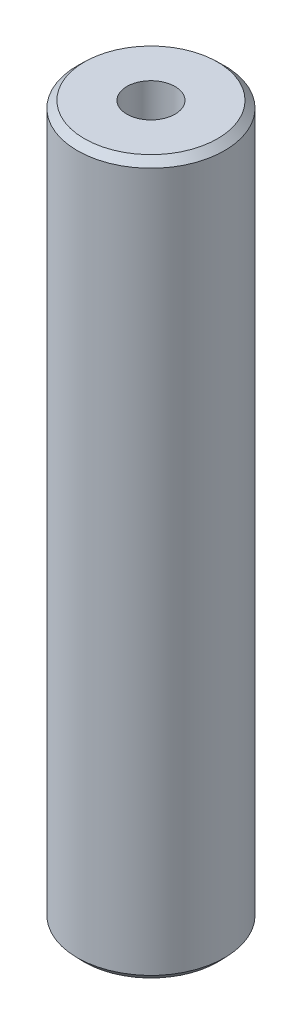
ISO-10303-21;
HEADER;
FILE_DESCRIPTION(('STEP AP214'),'2;1');
FILE_NAME('part.step','',(''),(''),'','','');
FILE_SCHEMA(('AUTOMOTIVE_DESIGN { 1 0 10303 214 1 1 1 1 }'));
ENDSEC;
DATA;
#1=APPLICATION_CONTEXT('core data for automotive mechanical design processes');
#2=APPLICATION_PROTOCOL_DEFINITION('international standard','automotive_design',2000,#1);
#3=PRODUCT_CONTEXT('',#1,'mechanical');
#4=PRODUCT('Part','Part','',(#3));
#5=PRODUCT_RELATED_PRODUCT_CATEGORY('part','',(#4));
#6=PRODUCT_DEFINITION_FORMATION('','',#4);
#7=PRODUCT_DEFINITION_CONTEXT('part definition',#1,'design');
#8=PRODUCT_DEFINITION('design','',#6,#7);
#9=PRODUCT_DEFINITION_SHAPE('','',#8);
#10=(LENGTH_UNIT() NAMED_UNIT(*) SI_UNIT(.MILLI.,.METRE.));
#11=(NAMED_UNIT(*) PLANE_ANGLE_UNIT() SI_UNIT($,.RADIAN.));
#12=(NAMED_UNIT(*) SI_UNIT($,.STERADIAN.) SOLID_ANGLE_UNIT());
#13=UNCERTAINTY_MEASURE_WITH_UNIT(LENGTH_MEASURE(1.E-05),#10,'distance_accuracy_value','');
#14=(GEOMETRIC_REPRESENTATION_CONTEXT(3) GLOBAL_UNCERTAINTY_ASSIGNED_CONTEXT((#13)) GLOBAL_UNIT_ASSIGNED_CONTEXT((#10,
#11,#12)) REPRESENTATION_CONTEXT('',''));
#15=CARTESIAN_POINT('',(0.,0.,0.));
#16=DIRECTION('',(0.,0.,1.));
#17=DIRECTION('',(1.,0.,0.));
#18=AXIS2_PLACEMENT_3D('',#15,#16,#17);
#19=CARTESIAN_POINT('',(0.,242.061241205621,0.));
#20=DIRECTION('',(0.,-1.,0.));
#21=DIRECTION('',(0.,0.,-1.));
#22=AXIS2_PLACEMENT_3D('',#19,#20,#21);
#23=CYLINDRICAL_SURFACE('',#22,25.);
#24=CARTESIAN_POINT('',(0.,239.752284655385,0.));
#25=DIRECTION('',(0.,1.,0.));
#26=DIRECTION('',(0.,0.,1.));
#27=AXIS2_PLACEMENT_3D('',#24,#25,#26);
#28=CIRCLE('',#27,25.);
#29=CARTESIAN_POINT('',(0.,239.752284655385,25.));
#30=VERTEX_POINT('',#29);
#31=EDGE_CURVE('E50',#30,#30,#28,.F.);
#32=ORIENTED_EDGE('',*,*,#31,.T.);
#33=EDGE_LOOP('',(#32));
#34=FACE_BOUND('',#33,.T.);
#35=CARTESIAN_POINT('',(0.,2.40373485333537,0.));
#36=DIRECTION('',(0.,1.,0.));
#37=DIRECTION('',(0.,0.,1.));
#38=AXIS2_PLACEMENT_3D('',#35,#36,#37);
#39=CIRCLE('',#38,25.);
#40=CARTESIAN_POINT('',(0.,2.40373485333537,25.));
#41=VERTEX_POINT('',#40);
#42=EDGE_CURVE('E51',#41,#41,#39,.T.);
#43=ORIENTED_EDGE('',*,*,#42,.T.);
#44=EDGE_LOOP('',(#43));
#45=FACE_BOUND('',#44,.T.);
#46=ADVANCED_FACE('F39',(#34,#45),#23,.T.);
#47=CARTESIAN_POINT('',(0.,242.061241205621,0.));
#48=DIRECTION('',(0.,1.,0.));
#49=DIRECTION('',(0.,0.,1.));
#50=AXIS2_PLACEMENT_3D('',#47,#48,#49);
#51=PLANE('',#50);
#52=CARTESIAN_POINT('',(0.,242.061241205621,0.));
#53=DIRECTION('',(0.,1.,0.));
#54=DIRECTION('',(0.,0.,1.));
#55=AXIS2_PLACEMENT_3D('',#52,#53,#54);
#56=CIRCLE('',#55,22.5962651466647);
#57=CARTESIAN_POINT('',(0.,242.061241205621,22.5962651466647));
#58=VERTEX_POINT('',#57);
#59=EDGE_CURVE('E54',#58,#58,#56,.T.);
#60=ORIENTED_EDGE('',*,*,#59,.T.);
#61=EDGE_LOOP('',(#60));
#62=FACE_BOUND('',#61,.T.);
#63=CARTESIAN_POINT('',(0.,242.061241205621,0.));
#64=DIRECTION('',(0.,1.,0.));
#65=DIRECTION('',(0.,0.,1.));
#66=AXIS2_PLACEMENT_3D('',#63,#64,#65);
#67=CIRCLE('',#66,8.1752864030035);
#68=CARTESIAN_POINT('',(0.,242.061241205621,8.1752864030035));
#69=VERTEX_POINT('',#68);
#70=EDGE_CURVE('E58',#69,#69,#67,.T.);
#71=ORIENTED_EDGE('',*,*,#70,.F.);
#72=EDGE_LOOP('',(#71));
#73=FACE_BOUND('',#72,.T.);
#74=ADVANCED_FACE('F69',(#62,#73),#51,.T.);
#75=CARTESIAN_POINT('',(0.,0.,0.));
#76=DIRECTION('',(0.,1.,0.));
#77=DIRECTION('',(0.,0.,1.));
#78=AXIS2_PLACEMENT_3D('',#75,#76,#77);
#79=PLANE('',#78);
#80=CARTESIAN_POINT('',(0.,0.,0.));
#81=DIRECTION('',(0.,1.,0.));
#82=DIRECTION('',(0.,0.,1.));
#83=AXIS2_PLACEMENT_3D('',#80,#81,#82);
#84=CIRCLE('',#83,22.6910434497641);
#85=CARTESIAN_POINT('',(0.,0.,22.6910434497641));
#86=VERTEX_POINT('',#85);
#87=EDGE_CURVE('E10',#86,#86,#84,.F.);
#88=ORIENTED_EDGE('',*,*,#87,.T.);
#89=EDGE_LOOP('',(#88));
#90=FACE_BOUND('',#89,.T.);
#91=CARTESIAN_POINT('',(0.,0.,0.));
#92=DIRECTION('',(0.,1.,0.));
#93=DIRECTION('',(0.,0.,1.));
#94=AXIS2_PLACEMENT_3D('',#91,#92,#93);
#95=CIRCLE('',#94,8.1752864030035);
#96=CARTESIAN_POINT('',(0.,0.,8.1752864030035));
#97=VERTEX_POINT('',#96);
#98=EDGE_CURVE('E63',#97,#97,#95,.T.);
#99=ORIENTED_EDGE('',*,*,#98,.T.);
#100=EDGE_LOOP('',(#99));
#101=FACE_BOUND('',#100,.T.);
#102=ADVANCED_FACE('F75',(#90,#101),#79,.F.);
#103=CARTESIAN_POINT('',(0.,242.061241205621,0.));
#104=DIRECTION('',(0.,-1.,0.));
#105=DIRECTION('',(0.,0.,-1.));
#106=AXIS2_PLACEMENT_3D('',#103,#104,#105);
#107=CYLINDRICAL_SURFACE('',#106,8.1752864030035);
#108=ORIENTED_EDGE('',*,*,#70,.T.);
#109=EDGE_LOOP('',(#108));
#110=FACE_BOUND('',#109,.T.);
#111=ORIENTED_EDGE('',*,*,#98,.F.);
#112=EDGE_LOOP('',(#111));
#113=FACE_BOUND('',#112,.T.);
#114=ADVANCED_FACE('F70',(#110,#113),#107,.F.);
#115=CARTESIAN_POINT('',(0.,242.061241205621,0.));
#116=DIRECTION('',(0.,-1.,0.));
#117=DIRECTION('',(0.,0.,-1.));
#118=AXIS2_PLACEMENT_3D('',#115,#116,#117);
#119=CONICAL_SURFACE('',#118,22.5962651466647,0.805506742539941);
#120=ORIENTED_EDGE('',*,*,#31,.F.);
#121=EDGE_LOOP('',(#120));
#122=FACE_BOUND('',#121,.T.);
#123=ORIENTED_EDGE('',*,*,#59,.F.);
#124=EDGE_LOOP('',(#123));
#125=FACE_BOUND('',#124,.T.);
#126=ADVANCED_FACE('F81',(#122,#125),#119,.T.);
#127=CARTESIAN_POINT('',(0.,2.40373485333537,0.));
#128=DIRECTION('',(0.,1.,0.));
#129=DIRECTION('',(0.,0.,1.));
#130=AXIS2_PLACEMENT_3D('',#127,#128,#129);
#131=CONICAL_SURFACE('',#130,25.,0.765289584254953);
#132=ORIENTED_EDGE('',*,*,#87,.F.);
#133=EDGE_LOOP('',(#132));
#134=FACE_BOUND('',#133,.T.);
#135=ORIENTED_EDGE('',*,*,#42,.F.);
#136=EDGE_LOOP('',(#135));
#137=FACE_BOUND('',#136,.T.);
#138=ADVANCED_FACE('F45',(#134,#137),#131,.T.);
#139=CLOSED_SHELL('',(#46,#74,#102,#114,#126,#138));
#140=MANIFOLD_SOLID_BREP('B2',#139);
#141=ADVANCED_BREP_SHAPE_REPRESENTATION('',(#18,#140),#14);
#142=SHAPE_DEFINITION_REPRESENTATION(#9,#141);
ENDSEC;
END-ISO-10303-21;
